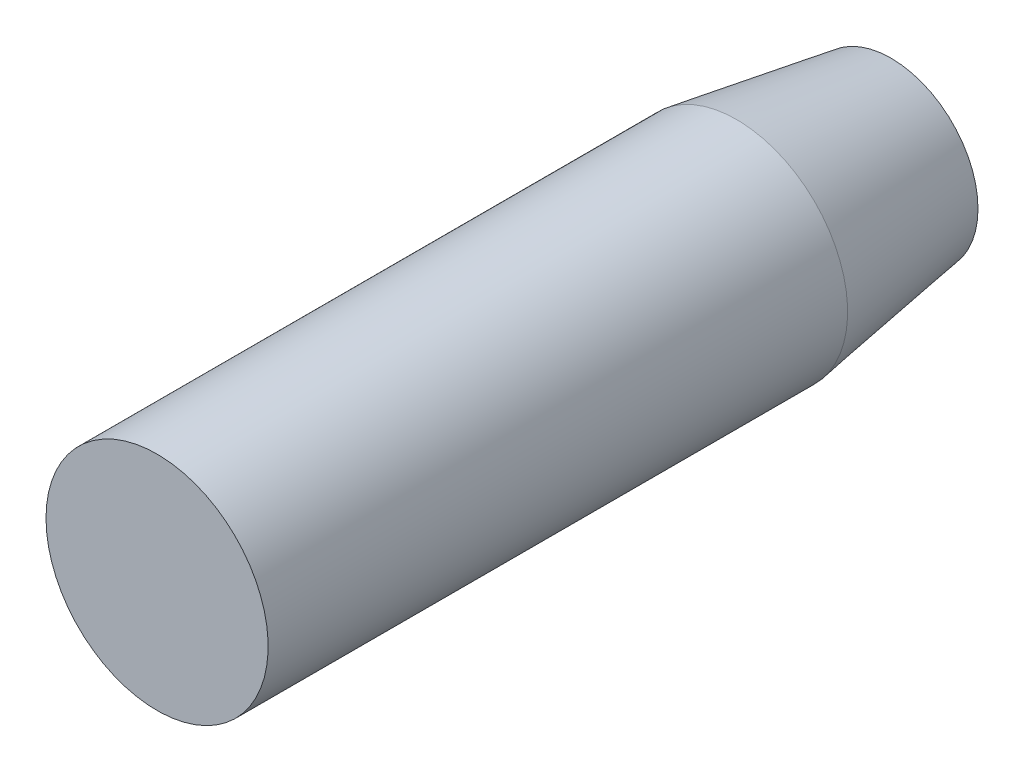
ISO-10303-21;
HEADER;
FILE_DESCRIPTION(('STEP AP214'),'2;1');
FILE_NAME('part.step','',(''),(''),'','','');
FILE_SCHEMA(('AUTOMOTIVE_DESIGN { 1 0 10303 214 1 1 1 1 }'));
ENDSEC;
DATA;
#1=APPLICATION_CONTEXT('core data for automotive mechanical design processes');
#2=APPLICATION_PROTOCOL_DEFINITION('international standard','automotive_design',2000,#1);
#3=PRODUCT_CONTEXT('',#1,'mechanical');
#4=PRODUCT('Part','Part','',(#3));
#5=PRODUCT_RELATED_PRODUCT_CATEGORY('part','',(#4));
#6=PRODUCT_DEFINITION_FORMATION('','',#4);
#7=PRODUCT_DEFINITION_CONTEXT('part definition',#1,'design');
#8=PRODUCT_DEFINITION('design','',#6,#7);
#9=PRODUCT_DEFINITION_SHAPE('','',#8);
#10=(LENGTH_UNIT() NAMED_UNIT(*) SI_UNIT(.MILLI.,.METRE.));
#11=(NAMED_UNIT(*) PLANE_ANGLE_UNIT() SI_UNIT($,.RADIAN.));
#12=(NAMED_UNIT(*) SI_UNIT($,.STERADIAN.) SOLID_ANGLE_UNIT());
#13=UNCERTAINTY_MEASURE_WITH_UNIT(LENGTH_MEASURE(1.E-05),#10,'distance_accuracy_value','');
#14=(GEOMETRIC_REPRESENTATION_CONTEXT(3) GLOBAL_UNCERTAINTY_ASSIGNED_CONTEXT((#13)) GLOBAL_UNIT_ASSIGNED_CONTEXT((#10,
#11,#12)) REPRESENTATION_CONTEXT('',''));
#15=CARTESIAN_POINT('',(0.,0.,0.));
#16=DIRECTION('',(0.,0.,1.));
#17=DIRECTION('',(1.,0.,0.));
#18=AXIS2_PLACEMENT_3D('',#15,#16,#17);
#19=CARTESIAN_POINT('',(0.,0.,-60.325));
#20=DIRECTION('',(0.,0.,1.));
#21=DIRECTION('',(-1.,0.,0.));
#22=AXIS2_PLACEMENT_3D('',#19,#20,#21);
#23=CYLINDRICAL_SURFACE('',#22,18.25625);
#24=CARTESIAN_POINT('',(0.,0.,-34.9250000000015));
#25=DIRECTION('',(0.,0.,1.));
#26=DIRECTION('',(1.,0.,0.));
#27=AXIS2_PLACEMENT_3D('',#24,#25,#26);
#28=CIRCLE('',#27,18.25625);
#29=CARTESIAN_POINT('',(-18.25625,0.,-34.9250000000015));
#30=VERTEX_POINT('',#29);
#31=EDGE_CURVE('E10',#30,#30,#28,.F.);
#32=CARTESIAN_POINT('',(0.,0.,60.325));
#33=DIRECTION('',(0.,0.,1.));
#34=DIRECTION('',(1.,0.,0.));
#35=AXIS2_PLACEMENT_3D('',#32,#33,#34);
#36=CIRCLE('',#35,18.25625);
#37=CARTESIAN_POINT('',(-18.25625,0.,60.325));
#38=VERTEX_POINT('',#37);
#39=EDGE_CURVE('E46',#38,#38,#36,.T.);
#40=CARTESIAN_POINT('',(-18.25625,0.,-34.9250000000015));
#41=CARTESIAN_POINT('',(-18.25625,0.,-33.9328125000015));
#42=CARTESIAN_POINT('',(-18.25625,0.,-32.9406250000014));
#43=CARTESIAN_POINT('',(-18.25625,0.,-30.9562500000014));
#44=CARTESIAN_POINT('',(-18.25625,0.,-29.9640625000014));
#45=CARTESIAN_POINT('',(-18.25625,0.,-27.9796875000014));
#46=CARTESIAN_POINT('',(-18.25625,0.,-26.9875000000014));
#47=CARTESIAN_POINT('',(-18.25625,0.,-25.0031250000013));
#48=CARTESIAN_POINT('',(-18.25625,0.,-24.0109375000013));
#49=CARTESIAN_POINT('',(-18.25625,0.,-22.0265625000013));
#50=CARTESIAN_POINT('',(-18.25625,0.,-21.0343750000013));
#51=CARTESIAN_POINT('',(-18.25625,0.,-19.0500000000012));
#52=CARTESIAN_POINT('',(-18.25625,0.,-18.0578125000012));
#53=CARTESIAN_POINT('',(-18.25625,0.,-16.0734375000012));
#54=CARTESIAN_POINT('',(-18.25625,0.,-15.0812500000012));
#55=CARTESIAN_POINT('',(-18.25625,0.,-13.0968750000011));
#56=CARTESIAN_POINT('',(-18.25625,0.,-12.1046875000011));
#57=CARTESIAN_POINT('',(-18.25625,0.,-10.1203125000011));
#58=CARTESIAN_POINT('',(-18.25625,0.,-9.12812500000108));
#59=CARTESIAN_POINT('',(-18.25625,0.,-7.14375000000105));
#60=CARTESIAN_POINT('',(-18.25625,0.,-6.15156250000103));
#61=CARTESIAN_POINT('',(-18.25625,0.,-4.167187500001));
#62=CARTESIAN_POINT('',(-18.25625,0.,-3.17500000000099));
#63=CARTESIAN_POINT('',(-18.25625,0.,-1.19062500000096));
#64=CARTESIAN_POINT('',(-18.25625,0.,-0.198437500000941));
#65=CARTESIAN_POINT('',(-18.25625,0.,1.78593749999909));
#66=CARTESIAN_POINT('',(-18.25625,0.,2.7781249999991));
#67=CARTESIAN_POINT('',(-18.25625,0.,4.76249999999913));
#68=CARTESIAN_POINT('',(-18.25625,0.,5.75468749999915));
#69=CARTESIAN_POINT('',(-18.25625,0.,7.73906249999918));
#70=CARTESIAN_POINT('',(-18.25625,0.,8.7312499999992));
#71=CARTESIAN_POINT('',(-18.25625,0.,10.7156249999992));
#72=CARTESIAN_POINT('',(-18.25625,0.,11.7078124999992));
#73=CARTESIAN_POINT('',(-18.25625,0.,13.6921874999993));
#74=CARTESIAN_POINT('',(-18.25625,0.,14.6843749999993));
#75=CARTESIAN_POINT('',(-18.25625,0.,16.6687499999993));
#76=CARTESIAN_POINT('',(-18.25625,0.,17.6609374999993));
#77=CARTESIAN_POINT('',(-18.25625,0.,19.6453124999994));
#78=CARTESIAN_POINT('',(-18.25625,0.,20.6374999999994));
#79=CARTESIAN_POINT('',(-18.25625,0.,22.6218749999994));
#80=CARTESIAN_POINT('',(-18.25625,0.,23.6140624999994));
#81=CARTESIAN_POINT('',(-18.25625,0.,25.5984374999995));
#82=CARTESIAN_POINT('',(-18.25625,0.,26.5906249999995));
#83=CARTESIAN_POINT('',(-18.25625,0.,28.5749999999995));
#84=CARTESIAN_POINT('',(-18.25625,0.,29.5671874999995));
#85=CARTESIAN_POINT('',(-18.25625,0.,31.5515624999995));
#86=CARTESIAN_POINT('',(-18.25625,0.,32.5437499999996));
#87=CARTESIAN_POINT('',(-18.25625,0.,34.5281249999996));
#88=CARTESIAN_POINT('',(-18.25625,0.,35.5203124999996));
#89=CARTESIAN_POINT('',(-18.25625,0.,37.5046874999996));
#90=CARTESIAN_POINT('',(-18.25625,0.,38.4968749999997));
#91=CARTESIAN_POINT('',(-18.25625,0.,40.4812499999997));
#92=CARTESIAN_POINT('',(-18.25625,0.,41.4734374999997));
#93=CARTESIAN_POINT('',(-18.25625,0.,43.4578124999997));
#94=CARTESIAN_POINT('',(-18.25625,0.,44.4499999999997));
#95=CARTESIAN_POINT('',(-18.25625,0.,46.4343749999998));
#96=CARTESIAN_POINT('',(-18.25625,0.,47.4265624999998));
#97=CARTESIAN_POINT('',(-18.25625,0.,49.4109374999998));
#98=CARTESIAN_POINT('',(-18.25625,0.,50.4031249999998));
#99=CARTESIAN_POINT('',(-18.25625,0.,52.3874999999999));
#100=CARTESIAN_POINT('',(-18.25625,0.,53.3796874999999));
#101=CARTESIAN_POINT('',(-18.25625,0.,55.3640624999999));
#102=CARTESIAN_POINT('',(-18.25625,0.,56.3562499999999));
#103=CARTESIAN_POINT('',(-18.25625,0.,58.340625));
#104=CARTESIAN_POINT('',(-18.25625,0.,59.3328125));
#105=CARTESIAN_POINT('',(-18.25625,0.,60.325));
#106=B_SPLINE_CURVE_WITH_KNOTS('',3,(#40,#41,#42,#43,#44,#45,#46,#47,#48,#49,#50,#51,#52,#53,
#54,#55,#56,#57,#58,#59,#60,#61,#62,#63,#64,#65,#66,#67,#68,#69,#70,#71,#72,#73,#74,#75,#76,#77,
#78,#79,#80,#81,#82,#83,#84,#85,#86,#87,#88,#89,#90,#91,#92,#93,#94,#95,#96,#97,#98,#99,#100,
#101,#102,#103,#104,#105),.UNSPECIFIED.,.F.,.F.,(4,2,2,2,2,2,2,2,2,2,2,2,2,2,2,2,2,2,2,2,2,2,2,
2,2,2,2,2,2,2,2,2,4),(0.,2.97656250000004,5.95312500000009,8.92968750000013,11.9062500000002,
14.8828125000002,17.8593750000003,20.8359375000003,23.8125000000004,26.7890625000004,
29.7656250000005,32.7421875000005,35.7187500000005,38.6953125000006,41.6718750000006,
44.6484375000007,47.6250000000007,50.6015625000008,53.5781250000008,56.5546875000009,
59.5312500000009,62.507812500001,65.484375000001,68.460937500001,71.4375000000011,
74.4140625000012,77.3906250000012,80.3671875000012,83.3437500000013,86.3203125000013,
89.2968750000014,92.2734375000014,95.2500000000015),.UNSPECIFIED.);
#107=EDGE_CURVE('BSEAM35',#30,#38,#106,.T.);
#108=ORIENTED_EDGE('',*,*,#31,.F.);
#109=ORIENTED_EDGE('',*,*,#39,.F.);
#110=ORIENTED_EDGE('',*,*,#107,.T.);
#111=ORIENTED_EDGE('',*,*,#107,.F.);
#112=EDGE_LOOP('',(#108,#110,#109,#111));
#113=FACE_BOUND('',#112,.T.);
#114=ADVANCED_FACE('F35',(#113),#23,.T.);
#115=CARTESIAN_POINT('',(0.,0.,-60.325));
#116=DIRECTION('',(0.,0.,-1.));
#117=DIRECTION('',(1.,0.,0.));
#118=AXIS2_PLACEMENT_3D('',#115,#116,#117);
#119=PLANE('',#118);
#120=CARTESIAN_POINT('',(0.,0.,-60.325));
#121=DIRECTION('',(0.,0.,1.));
#122=DIRECTION('',(1.,0.,0.));
#123=AXIS2_PLACEMENT_3D('',#120,#121,#122);
#124=CIRCLE('',#123,14.2875000000003);
#125=CARTESIAN_POINT('',(-14.2875000000003,0.,-60.325));
#126=VERTEX_POINT('',#125);
#127=EDGE_CURVE('E42',#126,#126,#124,.T.);
#128=ORIENTED_EDGE('',*,*,#127,.F.);
#129=EDGE_LOOP('',(#128));
#130=FACE_BOUND('',#129,.T.);
#131=ADVANCED_FACE('F56',(#130),#119,.T.);
#132=CARTESIAN_POINT('',(0.,0.,60.325));
#133=DIRECTION('',(0.,0.,-1.));
#134=DIRECTION('',(1.,0.,0.));
#135=AXIS2_PLACEMENT_3D('',#132,#133,#134);
#136=PLANE('',#135);
#137=ORIENTED_EDGE('',*,*,#39,.T.);
#138=EDGE_LOOP('',(#137));
#139=FACE_BOUND('',#138,.T.);
#140=ADVANCED_FACE('F53',(#139),#136,.F.);
#141=CARTESIAN_POINT('',(0.,0.,-60.325));
#142=DIRECTION('',(0.,0.,1.));
#143=DIRECTION('',(-1.,0.,0.));
#144=AXIS2_PLACEMENT_3D('',#141,#142,#143);
#145=CONICAL_SURFACE('',#144,14.2875000000003,0.154996741923938);
#146=CARTESIAN_POINT('',(-18.25625,0.,-34.9250000000015));
#147=CARTESIAN_POINT('',(-18.2149088541667,0.,-35.1895833333348));
#148=CARTESIAN_POINT('',(-18.1735677083333,0.,-35.4541666666681));
#149=CARTESIAN_POINT('',(-18.0908854166667,0.,-35.9833333333347));
#150=CARTESIAN_POINT('',(-18.0495442708333,0.,-36.2479166666681));
#151=CARTESIAN_POINT('',(-17.9668619791667,0.,-36.7770833333347));
#152=CARTESIAN_POINT('',(-17.9255208333334,0.,-37.041666666668));
#153=CARTESIAN_POINT('',(-17.8428385416667,0.,-37.5708333333346));
#154=CARTESIAN_POINT('',(-17.8014973958334,0.,-37.835416666668));
#155=CARTESIAN_POINT('',(-17.7188151041667,0.,-38.3645833333346));
#156=CARTESIAN_POINT('',(-17.6774739583334,0.,-38.6291666666679));
#157=CARTESIAN_POINT('',(-17.5947916666667,0.,-39.1583333333346));
#158=CARTESIAN_POINT('',(-17.5534505208334,0.,-39.4229166666679));
#159=CARTESIAN_POINT('',(-17.4707682291667,0.,-39.9520833333345));
#160=CARTESIAN_POINT('',(-17.4294270833334,0.,-40.2166666666678));
#161=CARTESIAN_POINT('',(-17.3467447916667,0.,-40.7458333333345));
#162=CARTESIAN_POINT('',(-17.3054036458334,0.,-41.0104166666678));
#163=CARTESIAN_POINT('',(-17.2227213541668,0.,-41.5395833333344));
#164=CARTESIAN_POINT('',(-17.1813802083334,0.,-41.8041666666677));
#165=CARTESIAN_POINT('',(-17.0986979166668,0.,-42.3333333333344));
#166=CARTESIAN_POINT('',(-17.0573567708334,0.,-42.5979166666677));
#167=CARTESIAN_POINT('',(-16.9746744791668,0.,-43.1270833333343));
#168=CARTESIAN_POINT('',(-16.9333333333334,0.,-43.3916666666676));
#169=CARTESIAN_POINT('',(-16.8506510416668,0.,-43.9208333333343));
#170=CARTESIAN_POINT('',(-16.8093098958335,0.,-44.1854166666676));
#171=CARTESIAN_POINT('',(-16.7266276041668,0.,-44.7145833333342));
#172=CARTESIAN_POINT('',(-16.6852864583335,0.,-44.9791666666676));
#173=CARTESIAN_POINT('',(-16.6026041666668,0.,-45.5083333333342));
#174=CARTESIAN_POINT('',(-16.5612630208335,0.,-45.7729166666675));
#175=CARTESIAN_POINT('',(-16.4785807291668,0.,-46.3020833333341));
#176=CARTESIAN_POINT('',(-16.4372395833335,0.,-46.5666666666675));
#177=CARTESIAN_POINT('',(-16.3545572916668,0.,-47.0958333333341));
#178=CARTESIAN_POINT('',(-16.3132161458335,0.,-47.3604166666674));
#179=CARTESIAN_POINT('',(-16.2305338541668,0.,-47.8895833333341));
#180=CARTESIAN_POINT('',(-16.1891927083335,0.,-48.1541666666674));
#181=CARTESIAN_POINT('',(-16.1065104166668,0.,-48.683333333334));
#182=CARTESIAN_POINT('',(-16.0651692708335,0.,-48.9479166666673));
#183=CARTESIAN_POINT('',(-15.9824869791668,0.,-49.477083333334));
#184=CARTESIAN_POINT('',(-15.9411458333335,0.,-49.7416666666673));
#185=CARTESIAN_POINT('',(-15.8584635416669,0.,-50.2708333333339));
#186=CARTESIAN_POINT('',(-15.8171223958335,0.,-50.5354166666672));
#187=CARTESIAN_POINT('',(-15.7344401041669,0.,-51.0645833333339));
#188=CARTESIAN_POINT('',(-15.6930989583335,0.,-51.3291666666672));
#189=CARTESIAN_POINT('',(-15.6104166666669,0.,-51.8583333333338));
#190=CARTESIAN_POINT('',(-15.5690755208336,0.,-52.1229166666671));
#191=CARTESIAN_POINT('',(-15.4863932291669,0.,-52.6520833333338));
#192=CARTESIAN_POINT('',(-15.4450520833336,0.,-52.9166666666671));
#193=CARTESIAN_POINT('',(-15.3623697916669,0.,-53.4458333333337));
#194=CARTESIAN_POINT('',(-15.3210286458336,0.,-53.7104166666671));
#195=CARTESIAN_POINT('',(-15.2383463541669,0.,-54.2395833333337));
#196=CARTESIAN_POINT('',(-15.1970052083336,0.,-54.504166666667));
#197=CARTESIAN_POINT('',(-15.1143229166669,0.,-55.0333333333336));
#198=CARTESIAN_POINT('',(-15.0729817708336,0.,-55.297916666667));
#199=CARTESIAN_POINT('',(-14.9902994791669,0.,-55.8270833333336));
#200=CARTESIAN_POINT('',(-14.9489583333336,0.,-56.0916666666669));
#201=CARTESIAN_POINT('',(-14.8662760416669,0.,-56.6208333333336));
#202=CARTESIAN_POINT('',(-14.8249348958336,0.,-56.8854166666669));
#203=CARTESIAN_POINT('',(-14.7422526041669,0.,-57.4145833333335));
#204=CARTESIAN_POINT('',(-14.7009114583336,0.,-57.6791666666668));
#205=CARTESIAN_POINT('',(-14.618229166667,0.,-58.2083333333335));
#206=CARTESIAN_POINT('',(-14.5768880208336,0.,-58.4729166666668));
#207=CARTESIAN_POINT('',(-14.494205729167,0.,-59.0020833333334));
#208=CARTESIAN_POINT('',(-14.4528645833336,0.,-59.2666666666667));
#209=CARTESIAN_POINT('',(-14.370182291667,0.,-59.7958333333334));
#210=CARTESIAN_POINT('',(-14.3288411458337,0.,-60.0604166666667));
#211=CARTESIAN_POINT('',(-14.2875000000003,0.,-60.325));
#212=B_SPLINE_CURVE_WITH_KNOTS('',3,(#146,#147,#148,#149,#150,#151,#152,#153,#154,#155,#156,
#157,#158,#159,#160,#161,#162,#163,#164,#165,#166,#167,#168,#169,#170,#171,#172,#173,#174,#175,
#176,#177,#178,#179,#180,#181,#182,#183,#184,#185,#186,#187,#188,#189,#190,#191,#192,#193,#194,
#195,#196,#197,#198,#199,#200,#201,#202,#203,#204,#205,#206,#207,#208,#209,#210,#211),
.UNSPECIFIED.,.F.,.F.,(4,2,2,2,2,2,2,2,2,2,2,2,2,2,2,2,2,2,2,2,2,2,2,2,2,2,2,2,2,2,2,2,4),(0.,
0.803380903151949,1.6067618063039,2.41014270945585,3.2135236126078,4.01690451575974,
4.82028541891169,5.62366632206364,6.42704722521559,7.23042812836754,8.03380903151949,
8.83718993467144,9.64057083782339,10.4439517409753,11.2473326441273,12.0507135472792,
12.8540944504312,13.6574753535831,14.4608562567351,15.264237159887,16.067618063039,
16.8709989661909,17.6743798693429,18.4777607724948,19.2811416756468,20.0845225787987,
20.8879034819507,21.6912843851026,22.4946652882546,23.2980461914065,24.1014270945585,
24.9048079977104,25.7081889008623),.UNSPECIFIED.);
#213=EDGE_CURVE('BSEAM37',#30,#126,#212,.T.);
#214=ORIENTED_EDGE('',*,*,#31,.T.);
#215=ORIENTED_EDGE('',*,*,#127,.T.);
#216=ORIENTED_EDGE('',*,*,#213,.T.);
#217=ORIENTED_EDGE('',*,*,#213,.F.);
#218=EDGE_LOOP('',(#214,#216,#215,#217));
#219=FACE_BOUND('',#218,.T.);
#220=ADVANCED_FACE('F37',(#219),#145,.T.);
#221=CLOSED_SHELL('',(#114,#131,#140,#220));
#222=MANIFOLD_SOLID_BREP('B2',#221);
#223=ADVANCED_BREP_SHAPE_REPRESENTATION('',(#18,#222),#14);
#224=SHAPE_DEFINITION_REPRESENTATION(#9,#223);
ENDSEC;
END-ISO-10303-21;
